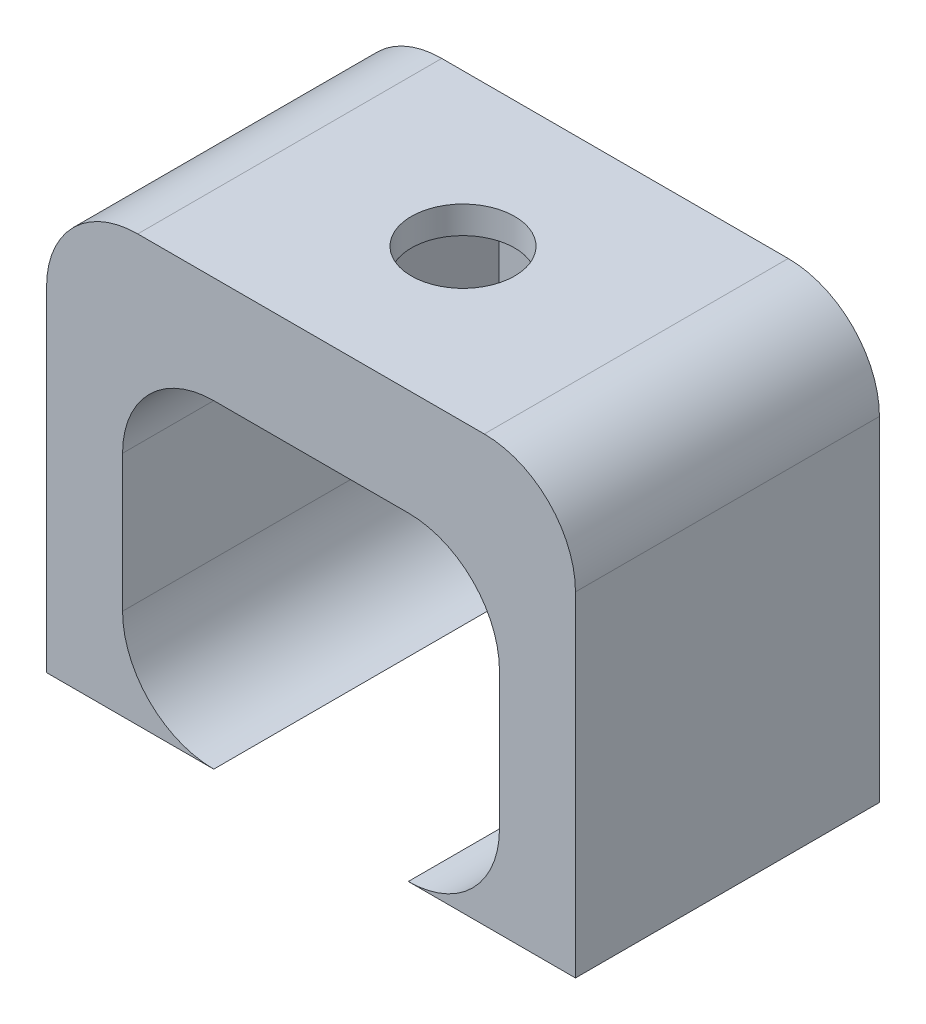
ISO-10303-21;
HEADER;
FILE_DESCRIPTION(('STEP AP214'),'2;1');
FILE_NAME('part.step','',(''),(''),'','','');
FILE_SCHEMA(('AUTOMOTIVE_DESIGN { 1 0 10303 214 1 1 1 1 }'));
ENDSEC;
DATA;
#1=APPLICATION_CONTEXT('core data for automotive mechanical design processes');
#2=APPLICATION_PROTOCOL_DEFINITION('international standard','automotive_design',2000,#1);
#3=PRODUCT_CONTEXT('',#1,'mechanical');
#4=PRODUCT('Part','Part','',(#3));
#5=PRODUCT_RELATED_PRODUCT_CATEGORY('part','',(#4));
#6=PRODUCT_DEFINITION_FORMATION('','',#4);
#7=PRODUCT_DEFINITION_CONTEXT('part definition',#1,'design');
#8=PRODUCT_DEFINITION('design','',#6,#7);
#9=PRODUCT_DEFINITION_SHAPE('','',#8);
#10=(LENGTH_UNIT() NAMED_UNIT(*) SI_UNIT(.MILLI.,.METRE.));
#11=(NAMED_UNIT(*) PLANE_ANGLE_UNIT() SI_UNIT($,.RADIAN.));
#12=(NAMED_UNIT(*) SI_UNIT($,.STERADIAN.) SOLID_ANGLE_UNIT());
#13=UNCERTAINTY_MEASURE_WITH_UNIT(LENGTH_MEASURE(1.E-05),#10,'distance_accuracy_value','');
#14=(GEOMETRIC_REPRESENTATION_CONTEXT(3) GLOBAL_UNCERTAINTY_ASSIGNED_CONTEXT((#13)) GLOBAL_UNIT_ASSIGNED_CONTEXT((#10,
#11,#12)) REPRESENTATION_CONTEXT('',''));
#15=CARTESIAN_POINT('',(0.,0.,0.));
#16=DIRECTION('',(0.,0.,1.));
#17=DIRECTION('',(1.,0.,0.));
#18=AXIS2_PLACEMENT_3D('',#15,#16,#17);
#19=CARTESIAN_POINT('',(-3.2,2.25,10.));
#20=DIRECTION('',(0.,0.,-1.));
#21=DIRECTION('',(-1.,0.,0.));
#22=AXIS2_PLACEMENT_3D('',#19,#20,#21);
#23=CYLINDRICAL_SURFACE('',#22,3.);
#24=CARTESIAN_POINT('',(-3.2,2.25,5.05743741577959));
#25=DIRECTION('',(0.866025403784439,0.,-0.5));
#26=DIRECTION('',(-0.5,0.,-0.866025403784439));
#27=AXIS2_PLACEMENT_3D('',#24,#25,#26);
#28=ELLIPSE('',#27,6.,3.);
#29=CARTESIAN_POINT('',(-3.2,5.25,5.0574374157796));
#30=VERTEX_POINT('',#29);
#31=CARTESIAN_POINT('',(-3.2331615074619,5.24981671347148,5.));
#32=VERTEX_POINT('',#31);
#33=EDGE_CURVE('E240',#30,#32,#28,.F.);
#34=ORIENTED_EDGE('',*,*,#33,.F.);
#35=DIRECTION('',(0.,0.,-1.));
#36=VECTOR('',#35,1.);
#37=CARTESIAN_POINT('',(-3.2,5.25,10.));
#38=LINE('',#37,#36);
#39=CARTESIAN_POINT('',(-3.2,5.25,10.));
#40=VERTEX_POINT('',#39);
#41=EDGE_CURVE('E318',#40,#30,#38,.T.);
#42=ORIENTED_EDGE('',*,*,#41,.F.);
#43=CARTESIAN_POINT('',(-3.2,2.25,10.));
#44=DIRECTION('',(0.,0.,-1.));
#45=DIRECTION('',(1.,0.,0.));
#46=AXIS2_PLACEMENT_3D('',#43,#44,#45);
#47=CIRCLE('',#46,3.);
#48=CARTESIAN_POINT('',(-6.2,2.25,10.));
#49=VERTEX_POINT('',#48);
#50=EDGE_CURVE('E249',#49,#40,#47,.T.);
#51=ORIENTED_EDGE('',*,*,#50,.F.);
#52=DIRECTION('',(0.,0.,-1.));
#53=VECTOR('',#52,1.);
#54=CARTESIAN_POINT('',(-6.2,2.25,10.));
#55=LINE('',#54,#53);
#56=CARTESIAN_POINT('',(-6.2,2.25,0.));
#57=VERTEX_POINT('',#56);
#58=EDGE_CURVE('E321',#49,#57,#55,.T.);
#59=ORIENTED_EDGE('',*,*,#58,.T.);
#60=CARTESIAN_POINT('',(-3.2,2.25,0.));
#61=DIRECTION('',(0.,0.,-1.));
#62=DIRECTION('',(1.,0.,0.));
#63=AXIS2_PLACEMENT_3D('',#60,#61,#62);
#64=CIRCLE('',#63,3.);
#65=CARTESIAN_POINT('',(-3.2,5.25,0.));
#66=VERTEX_POINT('',#65);
#67=EDGE_CURVE('E274',#57,#66,#64,.T.);
#68=ORIENTED_EDGE('',*,*,#67,.T.);
#69=CARTESIAN_POINT('',(-3.2,5.25,4.94256258422041));
#70=VERTEX_POINT('',#69);
#71=EDGE_CURVE('E317',#70,#66,#38,.T.);
#72=ORIENTED_EDGE('',*,*,#71,.F.);
#73=CARTESIAN_POINT('',(-3.2,2.25,4.94256258422041));
#74=DIRECTION('',(0.866025403784439,0.,0.5));
#75=DIRECTION('',(0.5,0.,-0.866025403784439));
#76=AXIS2_PLACEMENT_3D('',#73,#74,#75);
#77=ELLIPSE('',#76,6.00000000000001,3.);
#78=EDGE_CURVE('E238',#32,#70,#77,.F.);
#79=ORIENTED_EDGE('',*,*,#78,.F.);
#80=EDGE_LOOP('',(#34,#42,#51,#59,#68,#72,#79));
#81=FACE_BOUND('',#80,.T.);
#82=ADVANCED_FACE('F33',(#81),#23,.F.);
#83=CARTESIAN_POINT('',(-3.2,5.25,10.));
#84=DIRECTION('',(0.,1.,0.));
#85=DIRECTION('',(-1.,0.,0.));
#86=AXIS2_PLACEMENT_3D('',#83,#84,#85);
#87=PLANE('',#86);
#88=DIRECTION('',(-0.5,0.,0.866025403784439));
#89=VECTOR('',#88,1.);
#90=CARTESIAN_POINT('',(-0.540192378864667,5.25,11.5356406460551));
#91=LINE('',#90,#89);
#92=CARTESIAN_POINT('',(3.2,5.25,5.05743741577959));
#93=VERTEX_POINT('',#92);
#94=CARTESIAN_POINT('',(1.61658075373095,5.25,7.8));
#95=VERTEX_POINT('',#94);
#96=EDGE_CURVE('E196',#93,#95,#91,.T.);
#97=ORIENTED_EDGE('',*,*,#96,.F.);
#98=DIRECTION('',(0.,0.,-1.));
#99=VECTOR('',#98,1.);
#100=CARTESIAN_POINT('',(3.2,5.25,10.));
#101=LINE('',#100,#99);
#102=CARTESIAN_POINT('',(3.2,5.25,10.));
#103=VERTEX_POINT('',#102);
#104=EDGE_CURVE('E314',#103,#93,#101,.T.);
#105=ORIENTED_EDGE('',*,*,#104,.F.);
#106=DIRECTION('',(1.,0.,0.));
#107=VECTOR('',#106,1.);
#108=CARTESIAN_POINT('',(-3.2,5.25,10.));
#109=LINE('',#108,#107);
#110=EDGE_CURVE('E251',#40,#103,#109,.T.);
#111=ORIENTED_EDGE('',*,*,#110,.F.);
#112=ORIENTED_EDGE('',*,*,#41,.T.);
#113=DIRECTION('',(-0.5,0.,-0.866025403784439));
#114=VECTOR('',#113,1.);
#115=CARTESIAN_POINT('',(-1.05980762113533,5.25,8.7643593539449));
#116=LINE('',#115,#114);
#117=CARTESIAN_POINT('',(-1.61658075373095,5.25,7.8));
#118=VERTEX_POINT('',#117);
#119=EDGE_CURVE('E334',#118,#30,#116,.T.);
#120=ORIENTED_EDGE('',*,*,#119,.F.);
#121=DIRECTION('',(-1.,0.,0.));
#122=VECTOR('',#121,1.);
#123=CARTESIAN_POINT('',(-3.2,5.25,7.8));
#124=LINE('',#123,#122);
#125=EDGE_CURVE('E336',#95,#118,#124,.T.);
#126=ORIENTED_EDGE('',*,*,#125,.F.);
#127=EDGE_LOOP('',(#97,#105,#111,#112,#120,#126));
#128=FACE_BOUND('',#127,.T.);
#129=ADVANCED_FACE('F420',(#128),#87,.F.);
#130=DIRECTION('',(0.5,0.,0.866025403784439));
#131=VECTOR('',#130,1.);
#132=CARTESIAN_POINT('',(3.78993464005753,5.25,5.9643593539449));
#133=LINE('',#132,#131);
#134=CARTESIAN_POINT('',(1.61658075373095,5.25,2.2));
#135=VERTEX_POINT('',#134);
#136=CARTESIAN_POINT('',(3.2,5.25,4.94256258422041));
#137=VERTEX_POINT('',#136);
#138=EDGE_CURVE('E236',#135,#137,#133,.T.);
#139=ORIENTED_EDGE('',*,*,#138,.F.);
#140=DIRECTION('',(1.,0.,0.));
#141=VECTOR('',#140,1.);
#142=CARTESIAN_POINT('',(-3.2,5.25,2.2));
#143=LINE('',#142,#141);
#144=CARTESIAN_POINT('',(-1.61658075373095,5.25,2.2));
#145=VERTEX_POINT('',#144);
#146=EDGE_CURVE('E193',#145,#135,#143,.T.);
#147=ORIENTED_EDGE('',*,*,#146,.F.);
#148=DIRECTION('',(0.5,0.,-0.866025403784439));
#149=VECTOR('',#148,1.);
#150=CARTESIAN_POINT('',(-5.38993464005752,5.25,8.7356406460551));
#151=LINE('',#150,#149);
#152=EDGE_CURVE('E331',#70,#145,#151,.T.);
#153=ORIENTED_EDGE('',*,*,#152,.F.);
#154=ORIENTED_EDGE('',*,*,#71,.T.);
#155=DIRECTION('',(1.,0.,0.));
#156=VECTOR('',#155,1.);
#157=CARTESIAN_POINT('',(-3.2,5.25,0.));
#158=LINE('',#157,#156);
#159=CARTESIAN_POINT('',(3.2,5.25,0.));
#160=VERTEX_POINT('',#159);
#161=EDGE_CURVE('E277',#66,#160,#158,.T.);
#162=ORIENTED_EDGE('',*,*,#161,.T.);
#163=EDGE_CURVE('E313',#137,#160,#101,.T.);
#164=ORIENTED_EDGE('',*,*,#163,.F.);
#165=EDGE_LOOP('',(#139,#147,#153,#154,#162,#164));
#166=FACE_BOUND('',#165,.T.);
#167=ADVANCED_FACE('F387',(#166),#87,.F.);
#168=CARTESIAN_POINT('',(3.2,2.25,10.));
#169=DIRECTION('',(0.,0.,-1.));
#170=DIRECTION('',(-1.,0.,0.));
#171=AXIS2_PLACEMENT_3D('',#168,#169,#170);
#172=CYLINDRICAL_SURFACE('',#171,3.);
#173=CARTESIAN_POINT('',(3.2,2.25,4.9425625842204));
#174=DIRECTION('',(-0.866025403784439,0.,0.5));
#175=DIRECTION('',(-0.5,0.,-0.866025403784439));
#176=AXIS2_PLACEMENT_3D('',#173,#174,#175);
#177=ELLIPSE('',#176,6.,3.);
#178=CARTESIAN_POINT('',(3.23316150746191,5.24981671347148,5.));
#179=VERTEX_POINT('',#178);
#180=EDGE_CURVE('E329',#137,#179,#177,.F.);
#181=ORIENTED_EDGE('',*,*,#180,.F.);
#182=ORIENTED_EDGE('',*,*,#163,.T.);
#183=CARTESIAN_POINT('',(3.2,2.25,0.));
#184=DIRECTION('',(0.,0.,-1.));
#185=DIRECTION('',(-1.,0.,0.));
#186=AXIS2_PLACEMENT_3D('',#183,#184,#185);
#187=CIRCLE('',#186,3.);
#188=CARTESIAN_POINT('',(6.2,2.25,0.));
#189=VERTEX_POINT('',#188);
#190=EDGE_CURVE('E280',#160,#189,#187,.T.);
#191=ORIENTED_EDGE('',*,*,#190,.T.);
#192=DIRECTION('',(0.,0.,-1.));
#193=VECTOR('',#192,1.);
#194=CARTESIAN_POINT('',(6.2,2.25,10.));
#195=LINE('',#194,#193);
#196=CARTESIAN_POINT('',(6.2,2.25,10.));
#197=VERTEX_POINT('',#196);
#198=EDGE_CURVE('E310',#197,#189,#195,.T.);
#199=ORIENTED_EDGE('',*,*,#198,.F.);
#200=CARTESIAN_POINT('',(3.2,2.25,10.));
#201=DIRECTION('',(0.,0.,-1.));
#202=DIRECTION('',(-1.,0.,0.));
#203=AXIS2_PLACEMENT_3D('',#200,#201,#202);
#204=CIRCLE('',#203,3.);
#205=EDGE_CURVE('E253',#103,#197,#204,.T.);
#206=ORIENTED_EDGE('',*,*,#205,.F.);
#207=ORIENTED_EDGE('',*,*,#104,.T.);
#208=CARTESIAN_POINT('',(3.2,2.25,5.0574374157796));
#209=DIRECTION('',(-0.866025403784439,0.,-0.5));
#210=DIRECTION('',(0.5,0.,-0.866025403784439));
#211=AXIS2_PLACEMENT_3D('',#208,#209,#210);
#212=ELLIPSE('',#211,6.,3.);
#213=EDGE_CURVE('E327',#179,#93,#212,.F.);
#214=ORIENTED_EDGE('',*,*,#213,.F.);
#215=EDGE_LOOP('',(#181,#182,#191,#199,#206,#207,#214));
#216=FACE_BOUND('',#215,.T.);
#217=ADVANCED_FACE('F382',(#216),#172,.F.);
#218=CARTESIAN_POINT('',(-3.2,-2.25,10.));
#219=DIRECTION('',(0.,0.,-1.));
#220=DIRECTION('',(-1.,0.,0.));
#221=AXIS2_PLACEMENT_3D('',#218,#219,#220);
#222=CYLINDRICAL_SURFACE('',#221,3.);
#223=CARTESIAN_POINT('',(-3.2,-2.25,0.));
#224=DIRECTION('',(0.,0.,-1.));
#225=DIRECTION('',(1.,0.,0.));
#226=AXIS2_PLACEMENT_3D('',#223,#224,#225);
#227=CIRCLE('',#226,3.);
#228=CARTESIAN_POINT('',(-3.2,-5.25,0.));
#229=VERTEX_POINT('',#228);
#230=CARTESIAN_POINT('',(-6.2,-2.25,0.));
#231=VERTEX_POINT('',#230);
#232=EDGE_CURVE('E242',#229,#231,#227,.T.);
#233=ORIENTED_EDGE('',*,*,#232,.T.);
#234=DIRECTION('',(0.,0.,-1.));
#235=VECTOR('',#234,1.);
#236=CARTESIAN_POINT('',(-6.2,-2.25,10.));
#237=LINE('',#236,#235);
#238=CARTESIAN_POINT('',(-6.2,-2.25,10.));
#239=VERTEX_POINT('',#238);
#240=EDGE_CURVE('E324',#239,#231,#237,.T.);
#241=ORIENTED_EDGE('',*,*,#240,.F.);
#242=CARTESIAN_POINT('',(-3.2,-2.25,10.));
#243=DIRECTION('',(0.,0.,-1.));
#244=DIRECTION('',(1.,0.,0.));
#245=AXIS2_PLACEMENT_3D('',#242,#243,#244);
#246=CIRCLE('',#245,3.);
#247=CARTESIAN_POINT('',(-3.2,-5.25,10.));
#248=VERTEX_POINT('',#247);
#249=EDGE_CURVE('E243',#248,#239,#246,.T.);
#250=ORIENTED_EDGE('',*,*,#249,.F.);
#251=DIRECTION('',(0.,0.,-1.));
#252=VECTOR('',#251,1.);
#253=CARTESIAN_POINT('',(-3.2,-5.25,10.));
#254=LINE('',#253,#252);
#255=EDGE_CURVE('E269',#248,#229,#254,.T.);
#256=ORIENTED_EDGE('',*,*,#255,.T.);
#257=EDGE_LOOP('',(#233,#241,#250,#256));
#258=FACE_BOUND('',#257,.T.);
#259=ADVANCED_FACE('F403',(#258),#222,.F.);
#260=CARTESIAN_POINT('',(-6.2,2.25,10.));
#261=DIRECTION('',(-1.,0.,0.));
#262=DIRECTION('',(0.,-1.,0.));
#263=AXIS2_PLACEMENT_3D('',#260,#261,#262);
#264=PLANE('',#263);
#265=DIRECTION('',(0.,1.,0.));
#266=VECTOR('',#265,1.);
#267=CARTESIAN_POINT('',(-6.2,2.25,0.));
#268=LINE('',#267,#266);
#269=EDGE_CURVE('E272',#231,#57,#268,.T.);
#270=ORIENTED_EDGE('',*,*,#269,.T.);
#271=ORIENTED_EDGE('',*,*,#58,.F.);
#272=DIRECTION('',(0.,1.,0.));
#273=VECTOR('',#272,1.);
#274=CARTESIAN_POINT('',(-6.2,2.25,10.));
#275=LINE('',#274,#273);
#276=EDGE_CURVE('E246',#239,#49,#275,.T.);
#277=ORIENTED_EDGE('',*,*,#276,.F.);
#278=ORIENTED_EDGE('',*,*,#240,.T.);
#279=EDGE_LOOP('',(#270,#271,#277,#278));
#280=FACE_BOUND('',#279,.T.);
#281=ADVANCED_FACE('F397',(#280),#264,.F.);
#282=CARTESIAN_POINT('',(6.2,2.25,10.));
#283=DIRECTION('',(1.,0.,0.));
#284=DIRECTION('',(0.,0.,-1.));
#285=AXIS2_PLACEMENT_3D('',#282,#283,#284);
#286=PLANE('',#285);
#287=DIRECTION('',(0.,-1.,0.));
#288=VECTOR('',#287,1.);
#289=CARTESIAN_POINT('',(6.2,2.25,0.));
#290=LINE('',#289,#288);
#291=CARTESIAN_POINT('',(6.2,-2.25,0.));
#292=VERTEX_POINT('',#291);
#293=EDGE_CURVE('E282',#189,#292,#290,.T.);
#294=ORIENTED_EDGE('',*,*,#293,.T.);
#295=DIRECTION('',(0.,0.,-1.));
#296=VECTOR('',#295,1.);
#297=CARTESIAN_POINT('',(6.2,-2.25,10.));
#298=LINE('',#297,#296);
#299=CARTESIAN_POINT('',(6.2,-2.25,10.));
#300=VERTEX_POINT('',#299);
#301=EDGE_CURVE('E307',#300,#292,#298,.T.);
#302=ORIENTED_EDGE('',*,*,#301,.F.);
#303=DIRECTION('',(0.,-1.,0.));
#304=VECTOR('',#303,1.);
#305=CARTESIAN_POINT('',(6.2,2.25,10.));
#306=LINE('',#305,#304);
#307=EDGE_CURVE('E255',#197,#300,#306,.T.);
#308=ORIENTED_EDGE('',*,*,#307,.F.);
#309=ORIENTED_EDGE('',*,*,#198,.T.);
#310=EDGE_LOOP('',(#294,#302,#308,#309));
#311=FACE_BOUND('',#310,.T.);
#312=ADVANCED_FACE('F377',(#311),#286,.F.);
#313=CARTESIAN_POINT('',(3.2,-2.25,10.));
#314=DIRECTION('',(0.,0.,-1.));
#315=DIRECTION('',(-1.,0.,0.));
#316=AXIS2_PLACEMENT_3D('',#313,#314,#315);
#317=CYLINDRICAL_SURFACE('',#316,3.);
#318=CARTESIAN_POINT('',(3.2,-2.25,0.));
#319=DIRECTION('',(0.,0.,-1.));
#320=DIRECTION('',(1.,0.,0.));
#321=AXIS2_PLACEMENT_3D('',#318,#319,#320);
#322=CIRCLE('',#321,3.);
#323=CARTESIAN_POINT('',(3.2,-5.25,0.));
#324=VERTEX_POINT('',#323);
#325=EDGE_CURVE('E284',#292,#324,#322,.T.);
#326=ORIENTED_EDGE('',*,*,#325,.T.);
#327=DIRECTION('',(0.,0.,-1.));
#328=VECTOR('',#327,1.);
#329=CARTESIAN_POINT('',(3.2,-5.25,10.));
#330=LINE('',#329,#328);
#331=CARTESIAN_POINT('',(3.2,-5.25,10.));
#332=VERTEX_POINT('',#331);
#333=EDGE_CURVE('E304',#332,#324,#330,.T.);
#334=ORIENTED_EDGE('',*,*,#333,.F.);
#335=CARTESIAN_POINT('',(3.2,-2.25,10.));
#336=DIRECTION('',(0.,0.,-1.));
#337=DIRECTION('',(1.,0.,0.));
#338=AXIS2_PLACEMENT_3D('',#335,#336,#337);
#339=CIRCLE('',#338,3.);
#340=EDGE_CURVE('E257',#300,#332,#339,.T.);
#341=ORIENTED_EDGE('',*,*,#340,.F.);
#342=ORIENTED_EDGE('',*,*,#301,.T.);
#343=EDGE_LOOP('',(#326,#334,#341,#342));
#344=FACE_BOUND('',#343,.T.);
#345=ADVANCED_FACE('F372',(#344),#317,.F.);
#346=CARTESIAN_POINT('',(3.2,-5.25,10.));
#347=DIRECTION('',(0.,1.,0.));
#348=DIRECTION('',(-1.,0.,0.));
#349=AXIS2_PLACEMENT_3D('',#346,#347,#348);
#350=PLANE('',#349);
#351=DIRECTION('',(1.,0.,0.));
#352=VECTOR('',#351,1.);
#353=CARTESIAN_POINT('',(3.2,-5.25,0.));
#354=LINE('',#353,#352);
#355=CARTESIAN_POINT('',(8.7,-5.25,0.));
#356=VERTEX_POINT('',#355);
#357=EDGE_CURVE('E286',#324,#356,#354,.T.);
#358=ORIENTED_EDGE('',*,*,#357,.T.);
#359=DIRECTION('',(0.,0.,-1.));
#360=VECTOR('',#359,1.);
#361=CARTESIAN_POINT('',(8.7,-5.25,10.));
#362=LINE('',#361,#360);
#363=CARTESIAN_POINT('',(8.7,-5.25,10.));
#364=VERTEX_POINT('',#363);
#365=EDGE_CURVE('E301',#364,#356,#362,.T.);
#366=ORIENTED_EDGE('',*,*,#365,.F.);
#367=DIRECTION('',(1.,0.,0.));
#368=VECTOR('',#367,1.);
#369=CARTESIAN_POINT('',(3.2,-5.25,10.));
#370=LINE('',#369,#368);
#371=EDGE_CURVE('E259',#332,#364,#370,.T.);
#372=ORIENTED_EDGE('',*,*,#371,.F.);
#373=ORIENTED_EDGE('',*,*,#333,.T.);
#374=EDGE_LOOP('',(#358,#366,#372,#373));
#375=FACE_BOUND('',#374,.T.);
#376=ADVANCED_FACE('F366',(#375),#350,.F.);
#377=CARTESIAN_POINT('',(8.7,8.75,10.));
#378=DIRECTION('',(-1.,0.,0.));
#379=DIRECTION('',(0.,0.,1.));
#380=AXIS2_PLACEMENT_3D('',#377,#378,#379);
#381=PLANE('',#380);
#382=DIRECTION('',(0.,1.,0.));
#383=VECTOR('',#382,1.);
#384=CARTESIAN_POINT('',(8.7,8.75,0.));
#385=LINE('',#384,#383);
#386=CARTESIAN_POINT('',(8.7,5.75,0.));
#387=VERTEX_POINT('',#386);
#388=EDGE_CURVE('E288',#356,#387,#385,.T.);
#389=ORIENTED_EDGE('',*,*,#388,.T.);
#390=DIRECTION('',(0.,0.,-1.));
#391=VECTOR('',#390,1.);
#392=CARTESIAN_POINT('',(8.7,5.75,10.));
#393=LINE('',#392,#391);
#394=CARTESIAN_POINT('',(8.7,5.75,10.));
#395=VERTEX_POINT('',#394);
#396=EDGE_CURVE('E56',#387,#395,#393,.F.);
#397=ORIENTED_EDGE('',*,*,#396,.T.);
#398=DIRECTION('',(0.,1.,0.));
#399=VECTOR('',#398,1.);
#400=CARTESIAN_POINT('',(8.7,8.75,10.));
#401=LINE('',#400,#399);
#402=EDGE_CURVE('E261',#364,#395,#401,.T.);
#403=ORIENTED_EDGE('',*,*,#402,.F.);
#404=ORIENTED_EDGE('',*,*,#365,.T.);
#405=EDGE_LOOP('',(#389,#397,#403,#404));
#406=FACE_BOUND('',#405,.T.);
#407=ADVANCED_FACE('F362',(#406),#381,.F.);
#408=CARTESIAN_POINT('',(-8.7,8.75,10.));
#409=DIRECTION('',(0.,-1.,0.));
#410=DIRECTION('',(0.,0.,-1.));
#411=AXIS2_PLACEMENT_3D('',#408,#409,#410);
#412=PLANE('',#411);
#413=CARTESIAN_POINT('',(0.,8.75,5.));
#414=DIRECTION('',(0.,-1.,0.));
#415=DIRECTION('',(1.,0.,0.));
#416=AXIS2_PLACEMENT_3D('',#413,#414,#415);
#417=CIRCLE('',#416,1.7);
#418=CARTESIAN_POINT('',(1.7,8.75,5.));
#419=VERTEX_POINT('',#418);
#420=EDGE_CURVE('E212',#419,#419,#417,.T.);
#421=ORIENTED_EDGE('',*,*,#420,.T.);
#422=EDGE_LOOP('',(#421));
#423=FACE_BOUND('',#422,.T.);
#424=DIRECTION('',(-1.,0.,0.));
#425=VECTOR('',#424,1.);
#426=CARTESIAN_POINT('',(-8.7,8.75,10.));
#427=LINE('',#426,#425);
#428=CARTESIAN_POINT('',(5.7,8.75,10.));
#429=VERTEX_POINT('',#428);
#430=CARTESIAN_POINT('',(-5.7,8.75,10.));
#431=VERTEX_POINT('',#430);
#432=EDGE_CURVE('E263',#429,#431,#427,.T.);
#433=ORIENTED_EDGE('',*,*,#432,.F.);
#434=DIRECTION('',(0.,0.,-1.));
#435=VECTOR('',#434,1.);
#436=CARTESIAN_POINT('',(5.7,8.75,10.));
#437=LINE('',#436,#435);
#438=CARTESIAN_POINT('',(5.7,8.75,0.));
#439=VERTEX_POINT('',#438);
#440=EDGE_CURVE('E340',#429,#439,#437,.T.);
#441=ORIENTED_EDGE('',*,*,#440,.T.);
#442=DIRECTION('',(-1.,0.,0.));
#443=VECTOR('',#442,1.);
#444=CARTESIAN_POINT('',(-8.7,8.75,0.));
#445=LINE('',#444,#443);
#446=CARTESIAN_POINT('',(-5.7,8.75,0.));
#447=VERTEX_POINT('',#446);
#448=EDGE_CURVE('E290',#439,#447,#445,.T.);
#449=ORIENTED_EDGE('',*,*,#448,.T.);
#450=DIRECTION('',(0.,0.,-1.));
#451=VECTOR('',#450,1.);
#452=CARTESIAN_POINT('',(-5.7,8.75,10.));
#453=LINE('',#452,#451);
#454=EDGE_CURVE('E338',#447,#431,#453,.F.);
#455=ORIENTED_EDGE('',*,*,#454,.T.);
#456=EDGE_LOOP('',(#433,#441,#449,#455));
#457=FACE_BOUND('',#456,.T.);
#458=ADVANCED_FACE('F354',(#423,#457),#412,.F.);
#459=CARTESIAN_POINT('',(-8.7,8.75,10.));
#460=DIRECTION('',(1.,0.,0.));
#461=DIRECTION('',(0.,0.,-1.));
#462=AXIS2_PLACEMENT_3D('',#459,#460,#461);
#463=PLANE('',#462);
#464=DIRECTION('',(0.,-1.,0.));
#465=VECTOR('',#464,1.);
#466=CARTESIAN_POINT('',(-8.7,8.75,10.));
#467=LINE('',#466,#465);
#468=CARTESIAN_POINT('',(-8.7,5.75,10.));
#469=VERTEX_POINT('',#468);
#470=CARTESIAN_POINT('',(-8.7,-5.25,10.));
#471=VERTEX_POINT('',#470);
#472=EDGE_CURVE('E265',#469,#471,#467,.T.);
#473=ORIENTED_EDGE('',*,*,#472,.F.);
#474=DIRECTION('',(0.,0.,-1.));
#475=VECTOR('',#474,1.);
#476=CARTESIAN_POINT('',(-8.7,5.75,10.));
#477=LINE('',#476,#475);
#478=CARTESIAN_POINT('',(-8.7,5.75,0.));
#479=VERTEX_POINT('',#478);
#480=EDGE_CURVE('E11',#469,#479,#477,.T.);
#481=ORIENTED_EDGE('',*,*,#480,.T.);
#482=DIRECTION('',(0.,-1.,0.));
#483=VECTOR('',#482,1.);
#484=CARTESIAN_POINT('',(-8.7,8.75,0.));
#485=LINE('',#484,#483);
#486=CARTESIAN_POINT('',(-8.7,-5.25,0.));
#487=VERTEX_POINT('',#486);
#488=EDGE_CURVE('E293',#479,#487,#485,.T.);
#489=ORIENTED_EDGE('',*,*,#488,.T.);
#490=DIRECTION('',(0.,0.,-1.));
#491=VECTOR('',#490,1.);
#492=CARTESIAN_POINT('',(-8.7,-5.25,10.));
#493=LINE('',#492,#491);
#494=EDGE_CURVE('E298',#471,#487,#493,.T.);
#495=ORIENTED_EDGE('',*,*,#494,.F.);
#496=EDGE_LOOP('',(#473,#481,#489,#495));
#497=FACE_BOUND('',#496,.T.);
#498=ADVANCED_FACE('F411',(#497),#463,.F.);
#499=CARTESIAN_POINT('',(-8.7,-5.25,10.));
#500=DIRECTION('',(0.,1.,0.));
#501=DIRECTION('',(0.,0.,1.));
#502=AXIS2_PLACEMENT_3D('',#499,#500,#501);
#503=PLANE('',#502);
#504=DIRECTION('',(1.,0.,0.));
#505=VECTOR('',#504,1.);
#506=CARTESIAN_POINT('',(-8.7,-5.25,0.));
#507=LINE('',#506,#505);
#508=EDGE_CURVE('E247',#487,#229,#507,.T.);
#509=ORIENTED_EDGE('',*,*,#508,.T.);
#510=ORIENTED_EDGE('',*,*,#255,.F.);
#511=DIRECTION('',(1.,0.,0.));
#512=VECTOR('',#511,1.);
#513=CARTESIAN_POINT('',(-8.7,-5.25,10.));
#514=LINE('',#513,#512);
#515=EDGE_CURVE('E267',#471,#248,#514,.T.);
#516=ORIENTED_EDGE('',*,*,#515,.F.);
#517=ORIENTED_EDGE('',*,*,#494,.T.);
#518=EDGE_LOOP('',(#509,#510,#516,#517));
#519=FACE_BOUND('',#518,.T.);
#520=ADVANCED_FACE('F408',(#519),#503,.F.);
#521=CARTESIAN_POINT('',(-3.2,-2.25,10.));
#522=DIRECTION('',(0.,0.,1.));
#523=DIRECTION('',(1.,0.,0.));
#524=AXIS2_PLACEMENT_3D('',#521,#522,#523);
#525=PLANE('',#524);
#526=ORIENTED_EDGE('',*,*,#402,.T.);
#527=CARTESIAN_POINT('',(5.7,5.75,10.));
#528=DIRECTION('',(0.,0.,1.));
#529=DIRECTION('',(1.,0.,0.));
#530=AXIS2_PLACEMENT_3D('',#527,#528,#529);
#531=CIRCLE('',#530,3.);
#532=EDGE_CURVE('E41',#395,#429,#531,.T.);
#533=ORIENTED_EDGE('',*,*,#532,.T.);
#534=ORIENTED_EDGE('',*,*,#432,.T.);
#535=CARTESIAN_POINT('',(-5.7,5.75,10.));
#536=DIRECTION('',(0.,0.,1.));
#537=DIRECTION('',(1.,0.,0.));
#538=AXIS2_PLACEMENT_3D('',#535,#536,#537);
#539=CIRCLE('',#538,3.);
#540=EDGE_CURVE('E48',#431,#469,#539,.T.);
#541=ORIENTED_EDGE('',*,*,#540,.T.);
#542=ORIENTED_EDGE('',*,*,#472,.T.);
#543=ORIENTED_EDGE('',*,*,#515,.T.);
#544=ORIENTED_EDGE('',*,*,#249,.T.);
#545=ORIENTED_EDGE('',*,*,#276,.T.);
#546=ORIENTED_EDGE('',*,*,#50,.T.);
#547=ORIENTED_EDGE('',*,*,#110,.T.);
#548=ORIENTED_EDGE('',*,*,#205,.T.);
#549=ORIENTED_EDGE('',*,*,#307,.T.);
#550=ORIENTED_EDGE('',*,*,#340,.T.);
#551=ORIENTED_EDGE('',*,*,#371,.T.);
#552=EDGE_LOOP('',(#526,#533,#534,#541,#542,#543,#544,#545,#546,#547,#548,#549,#550,#551));
#553=FACE_BOUND('',#552,.T.);
#554=ADVANCED_FACE('F350',(#553),#525,.T.);
#555=CARTESIAN_POINT('',(-3.2,-2.25,0.));
#556=DIRECTION('',(0.,0.,1.));
#557=DIRECTION('',(1.,0.,0.));
#558=AXIS2_PLACEMENT_3D('',#555,#556,#557);
#559=PLANE('',#558);
#560=ORIENTED_EDGE('',*,*,#448,.F.);
#561=CARTESIAN_POINT('',(5.7,5.75,0.));
#562=DIRECTION('',(0.,0.,1.));
#563=DIRECTION('',(1.,0.,0.));
#564=AXIS2_PLACEMENT_3D('',#561,#562,#563);
#565=CIRCLE('',#564,3.);
#566=EDGE_CURVE('E345',#439,#387,#565,.F.);
#567=ORIENTED_EDGE('',*,*,#566,.T.);
#568=ORIENTED_EDGE('',*,*,#388,.F.);
#569=ORIENTED_EDGE('',*,*,#357,.F.);
#570=ORIENTED_EDGE('',*,*,#325,.F.);
#571=ORIENTED_EDGE('',*,*,#293,.F.);
#572=ORIENTED_EDGE('',*,*,#190,.F.);
#573=ORIENTED_EDGE('',*,*,#161,.F.);
#574=ORIENTED_EDGE('',*,*,#67,.F.);
#575=ORIENTED_EDGE('',*,*,#269,.F.);
#576=ORIENTED_EDGE('',*,*,#232,.F.);
#577=ORIENTED_EDGE('',*,*,#508,.F.);
#578=ORIENTED_EDGE('',*,*,#488,.F.);
#579=CARTESIAN_POINT('',(-5.7,5.75,0.));
#580=DIRECTION('',(0.,0.,1.));
#581=DIRECTION('',(1.,0.,0.));
#582=AXIS2_PLACEMENT_3D('',#579,#580,#581);
#583=CIRCLE('',#582,3.);
#584=EDGE_CURVE('E343',#479,#447,#583,.F.);
#585=ORIENTED_EDGE('',*,*,#584,.T.);
#586=EDGE_LOOP('',(#560,#567,#568,#569,#570,#571,#572,#573,#574,#575,#576,#577,#578,#585));
#587=FACE_BOUND('',#586,.T.);
#588=ADVANCED_FACE('F360',(#587),#559,.F.);
#589=CARTESIAN_POINT('',(-1.61658075373095,3.25,2.2));
#590=DIRECTION('',(0.,0.,1.));
#591=DIRECTION('',(1.,0.,0.));
#592=AXIS2_PLACEMENT_3D('',#589,#590,#591);
#593=PLANE('',#592);
#594=ORIENTED_EDGE('',*,*,#146,.T.);
#595=DIRECTION('',(0.,1.,0.));
#596=VECTOR('',#595,1.);
#597=CARTESIAN_POINT('',(1.61658075373095,3.25,2.2));
#598=LINE('',#597,#596);
#599=CARTESIAN_POINT('',(1.61658075373095,7.85,2.2));
#600=VERTEX_POINT('',#599);
#601=EDGE_CURVE('E185',#135,#600,#598,.T.);
#602=ORIENTED_EDGE('',*,*,#601,.T.);
#603=DIRECTION('',(1.,0.,0.));
#604=VECTOR('',#603,1.);
#605=CARTESIAN_POINT('',(-1.61658075373095,7.85,2.2));
#606=LINE('',#605,#604);
#607=CARTESIAN_POINT('',(-1.61658075373095,7.85,2.2));
#608=VERTEX_POINT('',#607);
#609=EDGE_CURVE('E190',#608,#600,#606,.T.);
#610=ORIENTED_EDGE('',*,*,#609,.F.);
#611=DIRECTION('',(0.,1.,0.));
#612=VECTOR('',#611,1.);
#613=CARTESIAN_POINT('',(-1.61658075373095,3.25,2.2));
#614=LINE('',#613,#612);
#615=EDGE_CURVE('E226',#145,#608,#614,.T.);
#616=ORIENTED_EDGE('',*,*,#615,.F.);
#617=EDGE_LOOP('',(#594,#602,#610,#616));
#618=FACE_BOUND('',#617,.T.);
#619=ADVANCED_FACE('F187',(#618),#593,.T.);
#620=CARTESIAN_POINT('',(1.61658075373095,3.25,7.8));
#621=DIRECTION('',(0.,0.,-1.));
#622=DIRECTION('',(-1.,0.,0.));
#623=AXIS2_PLACEMENT_3D('',#620,#621,#622);
#624=PLANE('',#623);
#625=ORIENTED_EDGE('',*,*,#125,.T.);
#626=DIRECTION('',(0.,1.,0.));
#627=VECTOR('',#626,1.);
#628=CARTESIAN_POINT('',(-1.61658075373095,3.25,7.8));
#629=LINE('',#628,#627);
#630=CARTESIAN_POINT('',(-1.61658075373095,7.85,7.8));
#631=VERTEX_POINT('',#630);
#632=EDGE_CURVE('E230',#118,#631,#629,.T.);
#633=ORIENTED_EDGE('',*,*,#632,.T.);
#634=DIRECTION('',(-1.,0.,0.));
#635=VECTOR('',#634,1.);
#636=CARTESIAN_POINT('',(1.61658075373095,7.85,7.8));
#637=LINE('',#636,#635);
#638=CARTESIAN_POINT('',(1.61658075373095,7.85,7.8));
#639=VERTEX_POINT('',#638);
#640=EDGE_CURVE('E220',#639,#631,#637,.T.);
#641=ORIENTED_EDGE('',*,*,#640,.F.);
#642=DIRECTION('',(0.,1.,0.));
#643=VECTOR('',#642,1.);
#644=CARTESIAN_POINT('',(1.61658075373095,3.25,7.8));
#645=LINE('',#644,#643);
#646=EDGE_CURVE('E232',#95,#639,#645,.T.);
#647=ORIENTED_EDGE('',*,*,#646,.F.);
#648=EDGE_LOOP('',(#625,#633,#641,#647));
#649=FACE_BOUND('',#648,.T.);
#650=ADVANCED_FACE('F460',(#649),#624,.T.);
#651=CARTESIAN_POINT('',(-1.61658075373095,3.25,7.8));
#652=DIRECTION('',(0.866025403784439,0.,-0.5));
#653=DIRECTION('',(-0.5,0.,-0.866025403784439));
#654=AXIS2_PLACEMENT_3D('',#651,#652,#653);
#655=PLANE('',#654);
#656=ORIENTED_EDGE('',*,*,#33,.T.);
#657=DIRECTION('',(0.,1.,0.));
#658=VECTOR('',#657,1.);
#659=CARTESIAN_POINT('',(-3.2331615074619,3.25,5.));
#660=LINE('',#659,#658);
#661=CARTESIAN_POINT('',(-3.23316150746191,7.85,5.));
#662=VERTEX_POINT('',#661);
#663=EDGE_CURVE('E228',#32,#662,#660,.T.);
#664=ORIENTED_EDGE('',*,*,#663,.T.);
#665=DIRECTION('',(-0.5,0.,-0.866025403784439));
#666=VECTOR('',#665,1.);
#667=CARTESIAN_POINT('',(-1.61658075373095,7.85,7.8));
#668=LINE('',#667,#666);
#669=EDGE_CURVE('E223',#631,#662,#668,.T.);
#670=ORIENTED_EDGE('',*,*,#669,.F.);
#671=ORIENTED_EDGE('',*,*,#632,.F.);
#672=ORIENTED_EDGE('',*,*,#119,.T.);
#673=EDGE_LOOP('',(#656,#664,#670,#671,#672));
#674=FACE_BOUND('',#673,.T.);
#675=ADVANCED_FACE('F470',(#674),#655,.T.);
#676=CARTESIAN_POINT('',(-3.2331615074619,3.25,5.));
#677=DIRECTION('',(0.866025403784439,0.,0.5));
#678=DIRECTION('',(0.5,0.,-0.866025403784439));
#679=AXIS2_PLACEMENT_3D('',#676,#677,#678);
#680=PLANE('',#679);
#681=ORIENTED_EDGE('',*,*,#78,.T.);
#682=ORIENTED_EDGE('',*,*,#152,.T.);
#683=ORIENTED_EDGE('',*,*,#615,.T.);
#684=DIRECTION('',(0.5,0.,-0.866025403784439));
#685=VECTOR('',#684,1.);
#686=CARTESIAN_POINT('',(-3.23316150746191,7.85,5.));
#687=LINE('',#686,#685);
#688=EDGE_CURVE('E211',#662,#608,#687,.T.);
#689=ORIENTED_EDGE('',*,*,#688,.F.);
#690=ORIENTED_EDGE('',*,*,#663,.F.);
#691=EDGE_LOOP('',(#681,#682,#683,#689,#690));
#692=FACE_BOUND('',#691,.T.);
#693=ADVANCED_FACE('F464',(#692),#680,.T.);
#694=CARTESIAN_POINT('',(1.61658075373095,3.25,2.2));
#695=DIRECTION('',(-0.866025403784439,0.,0.5));
#696=DIRECTION('',(0.5,0.,0.866025403784439));
#697=AXIS2_PLACEMENT_3D('',#694,#695,#696);
#698=PLANE('',#697);
#699=ORIENTED_EDGE('',*,*,#138,.T.);
#700=ORIENTED_EDGE('',*,*,#180,.T.);
#701=DIRECTION('',(0.,1.,0.));
#702=VECTOR('',#701,1.);
#703=CARTESIAN_POINT('',(3.23316150746191,3.25,5.));
#704=LINE('',#703,#702);
#705=CARTESIAN_POINT('',(3.2331615074619,7.85,5.));
#706=VERTEX_POINT('',#705);
#707=EDGE_CURVE('E197',#179,#706,#704,.T.);
#708=ORIENTED_EDGE('',*,*,#707,.T.);
#709=DIRECTION('',(0.5,0.,0.866025403784439));
#710=VECTOR('',#709,1.);
#711=CARTESIAN_POINT('',(1.61658075373095,7.85,2.2));
#712=LINE('',#711,#710);
#713=EDGE_CURVE('E200',#600,#706,#712,.T.);
#714=ORIENTED_EDGE('',*,*,#713,.F.);
#715=ORIENTED_EDGE('',*,*,#601,.F.);
#716=EDGE_LOOP('',(#699,#700,#708,#714,#715));
#717=FACE_BOUND('',#716,.T.);
#718=ADVANCED_FACE('F201',(#717),#698,.T.);
#719=CARTESIAN_POINT('',(3.23316150746191,3.25,5.));
#720=DIRECTION('',(-0.866025403784439,0.,-0.5));
#721=DIRECTION('',(-0.5,0.,0.866025403784439));
#722=AXIS2_PLACEMENT_3D('',#719,#720,#721);
#723=PLANE('',#722);
#724=ORIENTED_EDGE('',*,*,#96,.T.);
#725=ORIENTED_EDGE('',*,*,#646,.T.);
#726=DIRECTION('',(-0.5,0.,0.866025403784439));
#727=VECTOR('',#726,1.);
#728=CARTESIAN_POINT('',(3.2331615074619,7.85,5.));
#729=LINE('',#728,#727);
#730=EDGE_CURVE('E206',#706,#639,#729,.T.);
#731=ORIENTED_EDGE('',*,*,#730,.F.);
#732=ORIENTED_EDGE('',*,*,#707,.F.);
#733=ORIENTED_EDGE('',*,*,#213,.T.);
#734=EDGE_LOOP('',(#724,#725,#731,#732,#733));
#735=FACE_BOUND('',#734,.T.);
#736=ADVANCED_FACE('F463',(#735),#723,.T.);
#737=CARTESIAN_POINT('',(0.,7.85,0.));
#738=DIRECTION('',(0.,-1.,0.));
#739=DIRECTION('',(1.,0.,0.));
#740=AXIS2_PLACEMENT_3D('',#737,#738,#739);
#741=PLANE('',#740);
#742=CARTESIAN_POINT('',(0.,7.85,5.));
#743=DIRECTION('',(0.,-1.,0.));
#744=DIRECTION('',(1.,0.,0.));
#745=AXIS2_PLACEMENT_3D('',#742,#743,#744);
#746=CIRCLE('',#745,1.7);
#747=CARTESIAN_POINT('',(1.7,7.85,5.));
#748=VERTEX_POINT('',#747);
#749=EDGE_CURVE('E215',#748,#748,#746,.T.);
#750=ORIENTED_EDGE('',*,*,#749,.F.);
#751=EDGE_LOOP('',(#750));
#752=FACE_BOUND('',#751,.T.);
#753=ORIENTED_EDGE('',*,*,#609,.T.);
#754=ORIENTED_EDGE('',*,*,#713,.T.);
#755=ORIENTED_EDGE('',*,*,#730,.T.);
#756=ORIENTED_EDGE('',*,*,#640,.T.);
#757=ORIENTED_EDGE('',*,*,#669,.T.);
#758=ORIENTED_EDGE('',*,*,#688,.T.);
#759=EDGE_LOOP('',(#753,#754,#755,#756,#757,#758));
#760=FACE_BOUND('',#759,.T.);
#761=ADVANCED_FACE('F208',(#752,#760),#741,.T.);
#762=CARTESIAN_POINT('',(0.,8.75,5.));
#763=DIRECTION('',(0.,-1.,0.));
#764=DIRECTION('',(1.,0.,0.));
#765=AXIS2_PLACEMENT_3D('',#762,#763,#764);
#766=CYLINDRICAL_SURFACE('',#765,1.7);
#767=ORIENTED_EDGE('',*,*,#420,.F.);
#768=EDGE_LOOP('',(#767));
#769=FACE_BOUND('',#768,.T.);
#770=ORIENTED_EDGE('',*,*,#749,.T.);
#771=EDGE_LOOP('',(#770));
#772=FACE_BOUND('',#771,.T.);
#773=ADVANCED_FACE('F418',(#769,#772),#766,.F.);
#774=CARTESIAN_POINT('',(5.7,5.75,10.));
#775=DIRECTION('',(0.,0.,-1.));
#776=DIRECTION('',(-1.,0.,0.));
#777=AXIS2_PLACEMENT_3D('',#774,#775,#776);
#778=CYLINDRICAL_SURFACE('',#777,3.);
#779=ORIENTED_EDGE('',*,*,#532,.F.);
#780=ORIENTED_EDGE('',*,*,#396,.F.);
#781=ORIENTED_EDGE('',*,*,#566,.F.);
#782=ORIENTED_EDGE('',*,*,#440,.F.);
#783=EDGE_LOOP('',(#779,#780,#781,#782));
#784=FACE_BOUND('',#783,.T.);
#785=ADVANCED_FACE('F357',(#784),#778,.T.);
#786=CARTESIAN_POINT('',(-5.7,5.75,10.));
#787=DIRECTION('',(0.,0.,-1.));
#788=DIRECTION('',(-1.,0.,0.));
#789=AXIS2_PLACEMENT_3D('',#786,#787,#788);
#790=CYLINDRICAL_SURFACE('',#789,3.);
#791=ORIENTED_EDGE('',*,*,#540,.F.);
#792=ORIENTED_EDGE('',*,*,#454,.F.);
#793=ORIENTED_EDGE('',*,*,#584,.F.);
#794=ORIENTED_EDGE('',*,*,#480,.F.);
#795=EDGE_LOOP('',(#791,#792,#793,#794));
#796=FACE_BOUND('',#795,.T.);
#797=ADVANCED_FACE('F35',(#796),#790,.T.);
#798=CLOSED_SHELL('',(#82,#129,#167,#217,#259,#281,#312,#345,#376,#407,#458,#498,#520,#554,#588,
#619,#650,#675,#693,#718,#736,#761,#773,#785,#797));
#799=MANIFOLD_SOLID_BREP('B2',#798);
#800=ADVANCED_BREP_SHAPE_REPRESENTATION('',(#18,#799),#14);
#801=SHAPE_DEFINITION_REPRESENTATION(#9,#800);
ENDSEC;
END-ISO-10303-21;
